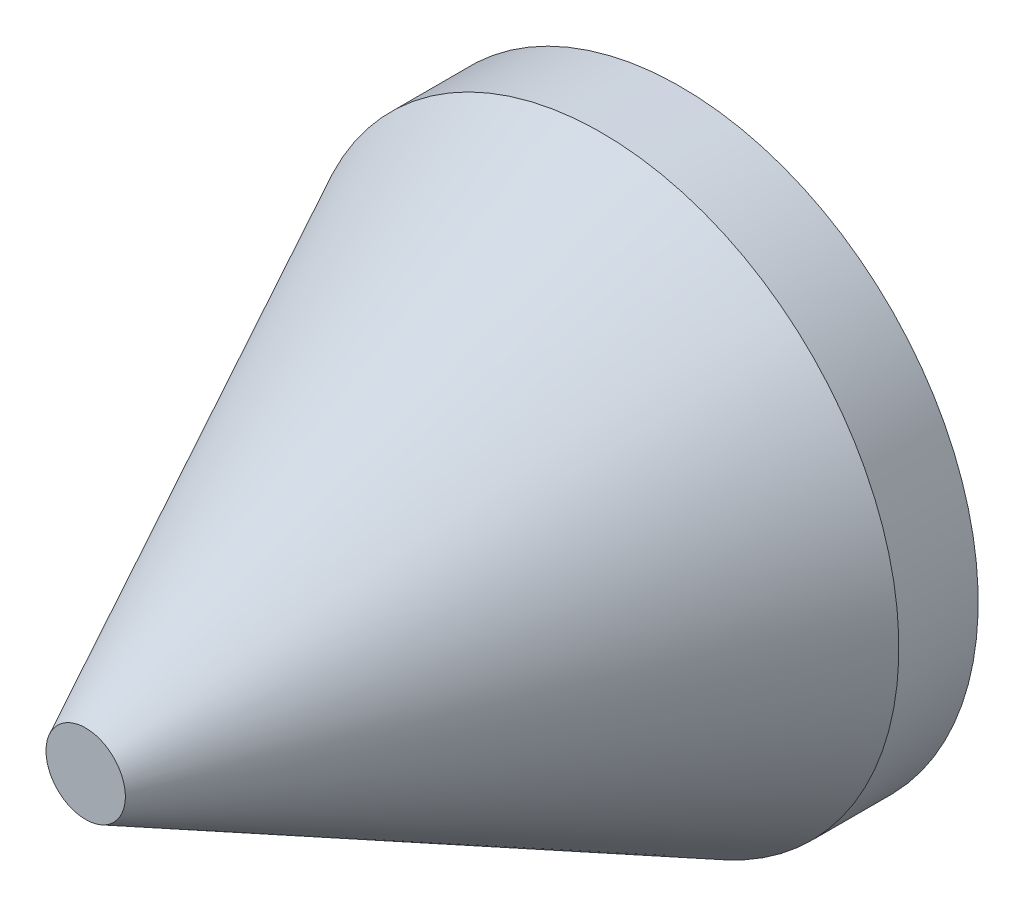
ISO-10303-21;
HEADER;
FILE_DESCRIPTION(('STEP AP214'),'2;1');
FILE_NAME('part.step','',(''),(''),'','','');
FILE_SCHEMA(('AUTOMOTIVE_DESIGN { 1 0 10303 214 1 1 1 1 }'));
ENDSEC;
DATA;
#1=APPLICATION_CONTEXT('core data for automotive mechanical design processes');
#2=APPLICATION_PROTOCOL_DEFINITION('international standard','automotive_design',2000,#1);
#3=PRODUCT_CONTEXT('',#1,'mechanical');
#4=PRODUCT('Part','Part','',(#3));
#5=PRODUCT_RELATED_PRODUCT_CATEGORY('part','',(#4));
#6=PRODUCT_DEFINITION_FORMATION('','',#4);
#7=PRODUCT_DEFINITION_CONTEXT('part definition',#1,'design');
#8=PRODUCT_DEFINITION('design','',#6,#7);
#9=PRODUCT_DEFINITION_SHAPE('','',#8);
#10=(LENGTH_UNIT() NAMED_UNIT(*) SI_UNIT(.MILLI.,.METRE.));
#11=(NAMED_UNIT(*) PLANE_ANGLE_UNIT() SI_UNIT($,.RADIAN.));
#12=(NAMED_UNIT(*) SI_UNIT($,.STERADIAN.) SOLID_ANGLE_UNIT());
#13=UNCERTAINTY_MEASURE_WITH_UNIT(LENGTH_MEASURE(1.E-05),#10,'distance_accuracy_value','');
#14=(GEOMETRIC_REPRESENTATION_CONTEXT(3) GLOBAL_UNCERTAINTY_ASSIGNED_CONTEXT((#13)) GLOBAL_UNIT_ASSIGNED_CONTEXT((#10,
#11,#12)) REPRESENTATION_CONTEXT('',''));
#15=CARTESIAN_POINT('',(0.,0.,0.));
#16=DIRECTION('',(0.,0.,1.));
#17=DIRECTION('',(1.,0.,0.));
#18=AXIS2_PLACEMENT_3D('',#15,#16,#17);
#19=CARTESIAN_POINT('',(0.,0.,150.));
#20=DIRECTION('',(0.,0.,-1.));
#21=DIRECTION('',(-1.,0.,0.));
#22=AXIS2_PLACEMENT_3D('',#19,#20,#21);
#23=PLANE('',#22);
#24=CARTESIAN_POINT('',(0.,0.,150.));
#25=DIRECTION('',(0.,0.,-1.));
#26=DIRECTION('',(-1.,0.,0.));
#27=AXIS2_PLACEMENT_3D('',#24,#25,#26);
#28=CIRCLE('',#27,10.);
#29=CARTESIAN_POINT('',(-10.,0.,150.));
#30=VERTEX_POINT('',#29);
#31=EDGE_CURVE('E43',#30,#30,#28,.T.);
#32=ORIENTED_EDGE('',*,*,#31,.F.);
#33=EDGE_LOOP('',(#32));
#34=FACE_BOUND('',#33,.T.);
#35=ADVANCED_FACE('F33',(#34),#23,.F.);
#36=CARTESIAN_POINT('',(75.,0.,0.));
#37=DIRECTION('',(0.,0.,1.));
#38=DIRECTION('',(1.,0.,0.));
#39=AXIS2_PLACEMENT_3D('',#36,#37,#38);
#40=PLANE('',#39);
#41=CARTESIAN_POINT('',(0.,0.,0.));
#42=DIRECTION('',(0.,0.,-1.));
#43=DIRECTION('',(-1.,0.,0.));
#44=AXIS2_PLACEMENT_3D('',#41,#42,#43);
#45=CIRCLE('',#44,75.);
#46=CARTESIAN_POINT('',(-75.,0.,0.));
#47=VERTEX_POINT('',#46);
#48=EDGE_CURVE('E10',#47,#47,#45,.T.);
#49=ORIENTED_EDGE('',*,*,#48,.T.);
#50=EDGE_LOOP('',(#49));
#51=FACE_BOUND('',#50,.T.);
#52=ADVANCED_FACE('F53',(#51),#40,.F.);
#53=CARTESIAN_POINT('',(0.,0.,-14.5438898450947));
#54=DIRECTION('',(0.,0.,-1.));
#55=DIRECTION('',(-1.,0.,0.));
#56=AXIS2_PLACEMENT_3D('',#53,#54,#55);
#57=CYLINDRICAL_SURFACE('',#56,75.);
#58=ORIENTED_EDGE('',*,*,#48,.F.);
#59=EDGE_LOOP('',(#58));
#60=FACE_BOUND('',#59,.T.);
#61=CARTESIAN_POINT('',(0.,0.,20.));
#62=DIRECTION('',(0.,0.,-1.));
#63=DIRECTION('',(-1.,0.,0.));
#64=AXIS2_PLACEMENT_3D('',#61,#62,#63);
#65=CIRCLE('',#64,75.);
#66=CARTESIAN_POINT('',(-75.,0.,20.));
#67=VERTEX_POINT('',#66);
#68=EDGE_CURVE('E39',#67,#67,#65,.T.);
#69=ORIENTED_EDGE('',*,*,#68,.T.);
#70=EDGE_LOOP('',(#69));
#71=FACE_BOUND('',#70,.T.);
#72=ADVANCED_FACE('F57',(#60,#71),#57,.T.);
#73=CARTESIAN_POINT('',(0.,0.,150.));
#74=DIRECTION('',(0.,0.,-1.));
#75=DIRECTION('',(-1.,0.,0.));
#76=AXIS2_PLACEMENT_3D('',#73,#74,#75);
#77=CONICAL_SURFACE('',#76,10.,0.463647609000806);
#78=ORIENTED_EDGE('',*,*,#68,.F.);
#79=EDGE_LOOP('',(#78));
#80=FACE_BOUND('',#79,.T.);
#81=ORIENTED_EDGE('',*,*,#31,.T.);
#82=EDGE_LOOP('',(#81));
#83=FACE_BOUND('',#82,.T.);
#84=ADVANCED_FACE('F50',(#80,#83),#77,.T.);
#85=CLOSED_SHELL('',(#35,#52,#72,#84));
#86=MANIFOLD_SOLID_BREP('B2',#85);
#87=ADVANCED_BREP_SHAPE_REPRESENTATION('',(#18,#86),#14);
#88=SHAPE_DEFINITION_REPRESENTATION(#9,#87);
ENDSEC;
END-ISO-10303-21;
